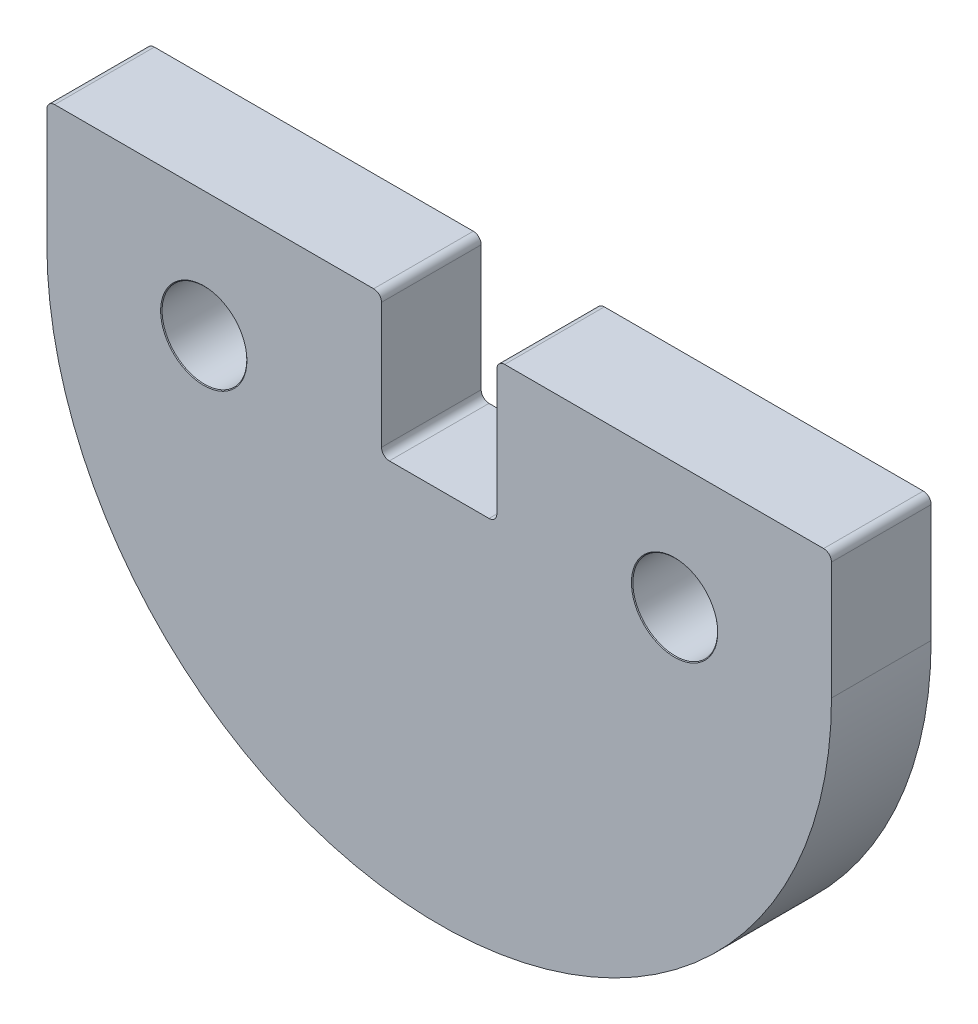
ISO-10303-21;
HEADER;
FILE_DESCRIPTION(('STEP AP214'),'2;1');
FILE_NAME('part.step','',(''),(''),'','','');
FILE_SCHEMA(('AUTOMOTIVE_DESIGN { 1 0 10303 214 1 1 1 1 }'));
ENDSEC;
DATA;
#1=APPLICATION_CONTEXT('core data for automotive mechanical design processes');
#2=APPLICATION_PROTOCOL_DEFINITION('international standard','automotive_design',2000,#1);
#3=PRODUCT_CONTEXT('',#1,'mechanical');
#4=PRODUCT('Part','Part','',(#3));
#5=PRODUCT_RELATED_PRODUCT_CATEGORY('part','',(#4));
#6=PRODUCT_DEFINITION_FORMATION('','',#4);
#7=PRODUCT_DEFINITION_CONTEXT('part definition',#1,'design');
#8=PRODUCT_DEFINITION('design','',#6,#7);
#9=PRODUCT_DEFINITION_SHAPE('','',#8);
#10=(LENGTH_UNIT() NAMED_UNIT(*) SI_UNIT(.MILLI.,.METRE.));
#11=(NAMED_UNIT(*) PLANE_ANGLE_UNIT() SI_UNIT($,.RADIAN.));
#12=(NAMED_UNIT(*) SI_UNIT($,.STERADIAN.) SOLID_ANGLE_UNIT());
#13=UNCERTAINTY_MEASURE_WITH_UNIT(LENGTH_MEASURE(1.E-05),#10,'distance_accuracy_value','');
#14=(GEOMETRIC_REPRESENTATION_CONTEXT(3) GLOBAL_UNCERTAINTY_ASSIGNED_CONTEXT((#13)) GLOBAL_UNIT_ASSIGNED_CONTEXT((#10,
#11,#12)) REPRESENTATION_CONTEXT('',''));
#15=CARTESIAN_POINT('',(0.,0.,0.));
#16=DIRECTION('',(0.,0.,1.));
#17=DIRECTION('',(1.,0.,0.));
#18=AXIS2_PLACEMENT_3D('',#15,#16,#17);
#19=CARTESIAN_POINT('',(-12.5,0.,3.175));
#20=DIRECTION('',(-1.,0.,0.));
#21=DIRECTION('',(0.,0.,1.));
#22=AXIS2_PLACEMENT_3D('',#19,#20,#21);
#23=PLANE('',#22);
#24=DIRECTION('',(0.,1.,0.));
#25=VECTOR('',#24,1.);
#26=CARTESIAN_POINT('',(-12.5,0.,3.175));
#27=LINE('',#26,#25);
#28=CARTESIAN_POINT('',(-12.5,0.,3.175));
#29=VERTEX_POINT('',#28);
#30=CARTESIAN_POINT('',(-12.5,3.75,3.175));
#31=VERTEX_POINT('',#30);
#32=EDGE_CURVE('E155',#29,#31,#27,.T.);
#33=ORIENTED_EDGE('',*,*,#32,.T.);
#34=DIRECTION('',(0.,0.,-1.));
#35=VECTOR('',#34,1.);
#36=CARTESIAN_POINT('',(-12.5,3.75,3.175));
#37=LINE('',#36,#35);
#38=CARTESIAN_POINT('',(-12.5,3.75,0.));
#39=VERTEX_POINT('',#38);
#40=EDGE_CURVE('E308',#31,#39,#37,.T.);
#41=ORIENTED_EDGE('',*,*,#40,.T.);
#42=DIRECTION('',(0.,1.,0.));
#43=VECTOR('',#42,1.);
#44=CARTESIAN_POINT('',(-12.5,0.,0.));
#45=LINE('',#44,#43);
#46=CARTESIAN_POINT('',(-12.5,0.,0.));
#47=VERTEX_POINT('',#46);
#48=EDGE_CURVE('E158',#47,#39,#45,.T.);
#49=ORIENTED_EDGE('',*,*,#48,.F.);
#50=DIRECTION('',(0.,0.,-1.));
#51=VECTOR('',#50,1.);
#52=CARTESIAN_POINT('',(-12.5,0.,3.175));
#53=LINE('',#52,#51);
#54=EDGE_CURVE('E151',#29,#47,#53,.T.);
#55=ORIENTED_EDGE('',*,*,#54,.F.);
#56=EDGE_LOOP('',(#33,#41,#49,#55));
#57=FACE_BOUND('',#56,.T.);
#58=ADVANCED_FACE('F48',(#57),#23,.T.);
#59=CARTESIAN_POINT('',(0.,0.,3.175));
#60=DIRECTION('',(0.,0.,-1.));
#61=DIRECTION('',(-1.,0.,0.));
#62=AXIS2_PLACEMENT_3D('',#59,#60,#61);
#63=CYLINDRICAL_SURFACE('',#62,12.5);
#64=CARTESIAN_POINT('',(0.,0.,0.));
#65=DIRECTION('',(0.,0.,1.));
#66=DIRECTION('',(1.,0.,0.));
#67=AXIS2_PLACEMENT_3D('',#64,#65,#66);
#68=CIRCLE('',#67,12.5);
#69=CARTESIAN_POINT('',(12.5,0.,0.));
#70=VERTEX_POINT('',#69);
#71=EDGE_CURVE('E220',#47,#70,#68,.T.);
#72=ORIENTED_EDGE('',*,*,#71,.T.);
#73=DIRECTION('',(0.,0.,-1.));
#74=VECTOR('',#73,1.);
#75=CARTESIAN_POINT('',(12.5,0.,3.175));
#76=LINE('',#75,#74);
#77=CARTESIAN_POINT('',(12.5,0.,3.175));
#78=VERTEX_POINT('',#77);
#79=EDGE_CURVE('E162',#78,#70,#76,.T.);
#80=ORIENTED_EDGE('',*,*,#79,.F.);
#81=CARTESIAN_POINT('',(0.,0.,3.175));
#82=DIRECTION('',(0.,0.,1.));
#83=DIRECTION('',(1.,0.,0.));
#84=AXIS2_PLACEMENT_3D('',#81,#82,#83);
#85=CIRCLE('',#84,12.5);
#86=EDGE_CURVE('E165',#29,#78,#85,.T.);
#87=ORIENTED_EDGE('',*,*,#86,.F.);
#88=ORIENTED_EDGE('',*,*,#54,.T.);
#89=EDGE_LOOP('',(#72,#80,#87,#88));
#90=FACE_BOUND('',#89,.T.);
#91=ADVANCED_FACE('F166',(#90),#63,.T.);
#92=CARTESIAN_POINT('',(12.5,0.,3.175));
#93=DIRECTION('',(-1.,0.,0.));
#94=DIRECTION('',(0.,0.,1.));
#95=AXIS2_PLACEMENT_3D('',#92,#93,#94);
#96=PLANE('',#95);
#97=DIRECTION('',(0.,1.,0.));
#98=VECTOR('',#97,1.);
#99=CARTESIAN_POINT('',(12.5,0.,0.));
#100=LINE('',#99,#98);
#101=CARTESIAN_POINT('',(12.5,3.75,0.));
#102=VERTEX_POINT('',#101);
#103=EDGE_CURVE('E222',#70,#102,#100,.T.);
#104=ORIENTED_EDGE('',*,*,#103,.T.);
#105=DIRECTION('',(0.,0.,-1.));
#106=VECTOR('',#105,1.);
#107=CARTESIAN_POINT('',(12.5,3.75,3.175));
#108=LINE('',#107,#106);
#109=CARTESIAN_POINT('',(12.5,3.75,3.175));
#110=VERTEX_POINT('',#109);
#111=EDGE_CURVE('E197',#102,#110,#108,.F.);
#112=ORIENTED_EDGE('',*,*,#111,.T.);
#113=DIRECTION('',(0.,1.,0.));
#114=VECTOR('',#113,1.);
#115=CARTESIAN_POINT('',(12.5,0.,3.175));
#116=LINE('',#115,#114);
#117=EDGE_CURVE('E171',#78,#110,#116,.T.);
#118=ORIENTED_EDGE('',*,*,#117,.F.);
#119=ORIENTED_EDGE('',*,*,#79,.T.);
#120=EDGE_LOOP('',(#104,#112,#118,#119));
#121=FACE_BOUND('',#120,.T.);
#122=ADVANCED_FACE('F249',(#121),#96,.F.);
#123=CARTESIAN_POINT('',(0.,4.,3.175));
#124=DIRECTION('',(0.,1.,0.));
#125=DIRECTION('',(0.,0.,1.));
#126=AXIS2_PLACEMENT_3D('',#123,#124,#125);
#127=PLANE('',#126);
#128=DIRECTION('',(1.,0.,0.));
#129=VECTOR('',#128,1.);
#130=CARTESIAN_POINT('',(0.,4.,3.175));
#131=LINE('',#130,#129);
#132=CARTESIAN_POINT('',(2.08750000000307,4.,3.175));
#133=VERTEX_POINT('',#132);
#134=CARTESIAN_POINT('',(12.25,4.,3.175));
#135=VERTEX_POINT('',#134);
#136=EDGE_CURVE('E256',#133,#135,#131,.T.);
#137=ORIENTED_EDGE('',*,*,#136,.T.);
#138=DIRECTION('',(0.,0.,-1.));
#139=VECTOR('',#138,1.);
#140=CARTESIAN_POINT('',(12.25,4.,0.));
#141=LINE('',#140,#139);
#142=CARTESIAN_POINT('',(12.25,4.,0.));
#143=VERTEX_POINT('',#142);
#144=EDGE_CURVE('E235',#135,#143,#141,.T.);
#145=ORIENTED_EDGE('',*,*,#144,.T.);
#146=DIRECTION('',(1.,0.,0.));
#147=VECTOR('',#146,1.);
#148=CARTESIAN_POINT('',(0.,4.,0.));
#149=LINE('',#148,#147);
#150=CARTESIAN_POINT('',(2.08750000000307,4.,0.));
#151=VERTEX_POINT('',#150);
#152=EDGE_CURVE('E182',#151,#143,#149,.T.);
#153=ORIENTED_EDGE('',*,*,#152,.F.);
#154=DIRECTION('',(0.,0.,-1.));
#155=VECTOR('',#154,1.);
#156=CARTESIAN_POINT('',(2.08750000000307,4.,3.175));
#157=LINE('',#156,#155);
#158=EDGE_CURVE('E161',#151,#133,#157,.F.);
#159=ORIENTED_EDGE('',*,*,#158,.T.);
#160=EDGE_LOOP('',(#137,#145,#153,#159));
#161=FACE_BOUND('',#160,.T.);
#162=ADVANCED_FACE('F285',(#161),#127,.T.);
#163=CARTESIAN_POINT('',(1.83750000000036,-1.32557990914983E-12,3.175));
#164=DIRECTION('',(1.,-7.21404032190244E-13,0.));
#165=DIRECTION('',(7.21404032190244E-13,1.,0.));
#166=AXIS2_PLACEMENT_3D('',#163,#164,#165);
#167=PLANE('',#166);
#168=DIRECTION('',(-7.21404032190244E-13,-1.,0.));
#169=VECTOR('',#168,1.);
#170=CARTESIAN_POINT('',(1.83750000000036,-1.32557990914983E-12,0.));
#171=LINE('',#170,#169);
#172=CARTESIAN_POINT('',(1.83750000000307,3.75000000000018,0.));
#173=VERTEX_POINT('',#172);
#174=CARTESIAN_POINT('',(1.83750000000018,-0.250000000000181,0.));
#175=VERTEX_POINT('',#174);
#176=EDGE_CURVE('E225',#173,#175,#171,.T.);
#177=ORIENTED_EDGE('',*,*,#176,.T.);
#178=DIRECTION('',(0.,0.,-1.));
#179=VECTOR('',#178,1.);
#180=CARTESIAN_POINT('',(1.83750000000018,-0.250000000000181,3.175));
#181=LINE('',#180,#179);
#182=CARTESIAN_POINT('',(1.83750000000018,-0.250000000000181,3.175));
#183=VERTEX_POINT('',#182);
#184=EDGE_CURVE('E296',#175,#183,#181,.F.);
#185=ORIENTED_EDGE('',*,*,#184,.T.);
#186=DIRECTION('',(-7.21404032190244E-13,-1.,0.));
#187=VECTOR('',#186,1.);
#188=CARTESIAN_POINT('',(1.83750000000036,-1.32557990914983E-12,3.175));
#189=LINE('',#188,#187);
#190=CARTESIAN_POINT('',(1.83750000000307,3.75000000000018,3.175));
#191=VERTEX_POINT('',#190);
#192=EDGE_CURVE('E275',#191,#183,#189,.T.);
#193=ORIENTED_EDGE('',*,*,#192,.F.);
#194=DIRECTION('',(0.,0.,-1.));
#195=VECTOR('',#194,1.);
#196=CARTESIAN_POINT('',(1.83750000000307,3.75000000000018,0.));
#197=LINE('',#196,#195);
#198=EDGE_CURVE('E293',#191,#173,#197,.T.);
#199=ORIENTED_EDGE('',*,*,#198,.T.);
#200=EDGE_LOOP('',(#177,#185,#193,#199));
#201=FACE_BOUND('',#200,.T.);
#202=ADVANCED_FACE('F320',(#201),#167,.F.);
#203=CARTESIAN_POINT('',(0.,-0.5,3.175));
#204=DIRECTION('',(0.,1.,0.));
#205=DIRECTION('',(0.,0.,1.));
#206=AXIS2_PLACEMENT_3D('',#203,#204,#205);
#207=PLANE('',#206);
#208=DIRECTION('',(1.,0.,0.));
#209=VECTOR('',#208,1.);
#210=CARTESIAN_POINT('',(0.,-0.5,0.));
#211=LINE('',#210,#209);
#212=CARTESIAN_POINT('',(-1.58750000000018,-0.5,0.));
#213=VERTEX_POINT('',#212);
#214=CARTESIAN_POINT('',(1.58750000000018,-0.5,0.));
#215=VERTEX_POINT('',#214);
#216=EDGE_CURVE('E228',#213,#215,#211,.T.);
#217=ORIENTED_EDGE('',*,*,#216,.F.);
#218=DIRECTION('',(0.,0.,-1.));
#219=VECTOR('',#218,1.);
#220=CARTESIAN_POINT('',(-1.58750000000018,-0.5,3.175));
#221=LINE('',#220,#219);
#222=CARTESIAN_POINT('',(-1.58750000000018,-0.5,3.175));
#223=VERTEX_POINT('',#222);
#224=EDGE_CURVE('E297',#213,#223,#221,.F.);
#225=ORIENTED_EDGE('',*,*,#224,.T.);
#226=DIRECTION('',(1.,0.,0.));
#227=VECTOR('',#226,1.);
#228=CARTESIAN_POINT('',(0.,-0.5,3.175));
#229=LINE('',#228,#227);
#230=CARTESIAN_POINT('',(1.58750000000018,-0.5,3.175));
#231=VERTEX_POINT('',#230);
#232=EDGE_CURVE('E216',#223,#231,#229,.T.);
#233=ORIENTED_EDGE('',*,*,#232,.T.);
#234=DIRECTION('',(0.,0.,-1.));
#235=VECTOR('',#234,1.);
#236=CARTESIAN_POINT('',(1.58750000000018,-0.5,3.175));
#237=LINE('',#236,#235);
#238=EDGE_CURVE('E300',#231,#215,#237,.T.);
#239=ORIENTED_EDGE('',*,*,#238,.T.);
#240=EDGE_LOOP('',(#217,#225,#233,#239));
#241=FACE_BOUND('',#240,.T.);
#242=ADVANCED_FACE('F325',(#241),#207,.T.);
#243=CARTESIAN_POINT('',(-1.83750000000036,-1.32557990914983E-12,3.175));
#244=DIRECTION('',(1.,7.21404032190244E-13,0.));
#245=DIRECTION('',(-7.21404032190244E-13,1.,0.));
#246=AXIS2_PLACEMENT_3D('',#243,#244,#245);
#247=PLANE('',#246);
#248=DIRECTION('',(7.21404032190244E-13,-1.,0.));
#249=VECTOR('',#248,1.);
#250=CARTESIAN_POINT('',(-1.83750000000036,-1.32557990914983E-12,3.175));
#251=LINE('',#250,#249);
#252=CARTESIAN_POINT('',(-1.83750000000307,3.75000000000018,3.175));
#253=VERTEX_POINT('',#252);
#254=CARTESIAN_POINT('',(-1.83750000000018,-0.250000000000181,3.175));
#255=VERTEX_POINT('',#254);
#256=EDGE_CURVE('E210',#253,#255,#251,.T.);
#257=ORIENTED_EDGE('',*,*,#256,.T.);
#258=DIRECTION('',(0.,0.,-1.));
#259=VECTOR('',#258,1.);
#260=CARTESIAN_POINT('',(-1.83750000000018,-0.250000000000181,0.));
#261=LINE('',#260,#259);
#262=CARTESIAN_POINT('',(-1.83750000000018,-0.250000000000181,0.));
#263=VERTEX_POINT('',#262);
#264=EDGE_CURVE('E262',#255,#263,#261,.T.);
#265=ORIENTED_EDGE('',*,*,#264,.T.);
#266=DIRECTION('',(7.21404032190244E-13,-1.,0.));
#267=VECTOR('',#266,1.);
#268=CARTESIAN_POINT('',(-1.83750000000036,-1.32557990914983E-12,0.));
#269=LINE('',#268,#267);
#270=CARTESIAN_POINT('',(-1.83750000000307,3.75000000000018,0.));
#271=VERTEX_POINT('',#270);
#272=EDGE_CURVE('E180',#271,#263,#269,.T.);
#273=ORIENTED_EDGE('',*,*,#272,.F.);
#274=DIRECTION('',(0.,0.,-1.));
#275=VECTOR('',#274,1.);
#276=CARTESIAN_POINT('',(-1.83750000000307,3.75000000000018,3.175));
#277=LINE('',#276,#275);
#278=EDGE_CURVE('E260',#271,#253,#277,.F.);
#279=ORIENTED_EDGE('',*,*,#278,.T.);
#280=EDGE_LOOP('',(#257,#265,#273,#279));
#281=FACE_BOUND('',#280,.T.);
#282=ADVANCED_FACE('F332',(#281),#247,.T.);
#283=CARTESIAN_POINT('',(-12.25,4.,3.175));
#284=VERTEX_POINT('',#283);
#285=CARTESIAN_POINT('',(-2.08750000000307,4.,3.175));
#286=VERTEX_POINT('',#285);
#287=EDGE_CURVE('E215',#284,#286,#131,.T.);
#288=ORIENTED_EDGE('',*,*,#287,.T.);
#289=DIRECTION('',(0.,0.,-1.));
#290=VECTOR('',#289,1.);
#291=CARTESIAN_POINT('',(-2.08750000000307,4.,3.175));
#292=LINE('',#291,#290);
#293=CARTESIAN_POINT('',(-2.08750000000307,4.,0.));
#294=VERTEX_POINT('',#293);
#295=EDGE_CURVE('E305',#286,#294,#292,.T.);
#296=ORIENTED_EDGE('',*,*,#295,.T.);
#297=CARTESIAN_POINT('',(-12.25,4.,0.));
#298=VERTEX_POINT('',#297);
#299=EDGE_CURVE('E176',#298,#294,#149,.T.);
#300=ORIENTED_EDGE('',*,*,#299,.F.);
#301=DIRECTION('',(0.,0.,-1.));
#302=VECTOR('',#301,1.);
#303=CARTESIAN_POINT('',(-12.25,4.,3.175));
#304=LINE('',#303,#302);
#305=EDGE_CURVE('E71',#298,#284,#304,.F.);
#306=ORIENTED_EDGE('',*,*,#305,.T.);
#307=EDGE_LOOP('',(#288,#296,#300,#306));
#308=FACE_BOUND('',#307,.T.);
#309=ADVANCED_FACE('F338',(#308),#127,.T.);
#310=CARTESIAN_POINT('',(0.,0.,3.175));
#311=DIRECTION('',(0.,0.,1.));
#312=DIRECTION('',(1.,0.,0.));
#313=AXIS2_PLACEMENT_3D('',#310,#311,#312);
#314=PLANE('',#313);
#315=CARTESIAN_POINT('',(-7.5,0.,3.175));
#316=DIRECTION('',(0.,0.,1.));
#317=DIRECTION('',(1.,0.,0.));
#318=AXIS2_PLACEMENT_3D('',#315,#316,#317);
#319=CIRCLE('',#318,1.375);
#320=CARTESIAN_POINT('',(-6.125,0.,3.175));
#321=VERTEX_POINT('',#320);
#322=EDGE_CURVE('E510',#321,#321,#319,.T.);
#323=ORIENTED_EDGE('',*,*,#322,.F.);
#324=EDGE_LOOP('',(#323));
#325=FACE_BOUND('',#324,.T.);
#326=CARTESIAN_POINT('',(7.5,0.,3.175));
#327=DIRECTION('',(0.,0.,1.));
#328=DIRECTION('',(1.,0.,0.));
#329=AXIS2_PLACEMENT_3D('',#326,#327,#328);
#330=CIRCLE('',#329,1.375);
#331=CARTESIAN_POINT('',(8.875,0.,3.175));
#332=VERTEX_POINT('',#331);
#333=EDGE_CURVE('E513',#332,#332,#330,.T.);
#334=ORIENTED_EDGE('',*,*,#333,.F.);
#335=EDGE_LOOP('',(#334));
#336=FACE_BOUND('',#335,.T.);
#337=ORIENTED_EDGE('',*,*,#117,.T.);
#338=CARTESIAN_POINT('',(12.25,3.75,3.175));
#339=DIRECTION('',(0.,0.,1.));
#340=DIRECTION('',(1.,0.,0.));
#341=AXIS2_PLACEMENT_3D('',#338,#339,#340);
#342=CIRCLE('',#341,0.25);
#343=EDGE_CURVE('E253',#110,#135,#342,.T.);
#344=ORIENTED_EDGE('',*,*,#343,.T.);
#345=ORIENTED_EDGE('',*,*,#136,.F.);
#346=CARTESIAN_POINT('',(2.08750000000307,3.75,3.175));
#347=DIRECTION('',(0.,0.,1.));
#348=DIRECTION('',(1.,0.,0.));
#349=AXIS2_PLACEMENT_3D('',#346,#347,#348);
#350=CIRCLE('',#349,0.25);
#351=EDGE_CURVE('E202',#133,#191,#350,.T.);
#352=ORIENTED_EDGE('',*,*,#351,.T.);
#353=ORIENTED_EDGE('',*,*,#192,.T.);
#354=CARTESIAN_POINT('',(1.58750000000018,-0.25,3.175));
#355=DIRECTION('',(0.,0.,1.));
#356=DIRECTION('',(1.,0.,0.));
#357=AXIS2_PLACEMENT_3D('',#354,#355,#356);
#358=CIRCLE('',#357,0.25);
#359=EDGE_CURVE('E12',#183,#231,#358,.F.);
#360=ORIENTED_EDGE('',*,*,#359,.T.);
#361=ORIENTED_EDGE('',*,*,#232,.F.);
#362=CARTESIAN_POINT('',(-1.58750000000018,-0.25,3.175));
#363=DIRECTION('',(0.,0.,1.));
#364=DIRECTION('',(1.,0.,0.));
#365=AXIS2_PLACEMENT_3D('',#362,#363,#364);
#366=CIRCLE('',#365,0.25);
#367=EDGE_CURVE('E312',#223,#255,#366,.F.);
#368=ORIENTED_EDGE('',*,*,#367,.T.);
#369=ORIENTED_EDGE('',*,*,#256,.F.);
#370=CARTESIAN_POINT('',(-2.08750000000307,3.75,3.175));
#371=DIRECTION('',(0.,0.,1.));
#372=DIRECTION('',(1.,0.,0.));
#373=AXIS2_PLACEMENT_3D('',#370,#371,#372);
#374=CIRCLE('',#373,0.25);
#375=EDGE_CURVE('E64',#253,#286,#374,.T.);
#376=ORIENTED_EDGE('',*,*,#375,.T.);
#377=ORIENTED_EDGE('',*,*,#287,.F.);
#378=CARTESIAN_POINT('',(-12.25,3.75,3.175));
#379=DIRECTION('',(0.,0.,1.));
#380=DIRECTION('',(1.,0.,0.));
#381=AXIS2_PLACEMENT_3D('',#378,#379,#380);
#382=CIRCLE('',#381,0.25);
#383=EDGE_CURVE('E174',#284,#31,#382,.T.);
#384=ORIENTED_EDGE('',*,*,#383,.T.);
#385=ORIENTED_EDGE('',*,*,#32,.F.);
#386=ORIENTED_EDGE('',*,*,#86,.T.);
#387=EDGE_LOOP('',(#337,#344,#345,#352,#353,#360,#361,#368,#369,#376,#377,#384,#385,#386));
#388=FACE_BOUND('',#387,.T.);
#389=ADVANCED_FACE('F172',(#325,#336,#388),#314,.T.);
#390=CARTESIAN_POINT('',(0.,0.,0.));
#391=DIRECTION('',(0.,0.,1.));
#392=DIRECTION('',(1.,0.,0.));
#393=AXIS2_PLACEMENT_3D('',#390,#391,#392);
#394=PLANE('',#393);
#395=CARTESIAN_POINT('',(-7.5,0.,0.));
#396=DIRECTION('',(0.,0.,1.));
#397=DIRECTION('',(1.,0.,0.));
#398=AXIS2_PLACEMENT_3D('',#395,#396,#397);
#399=CIRCLE('',#398,1.35);
#400=CARTESIAN_POINT('',(-6.15,0.,0.));
#401=VERTEX_POINT('',#400);
#402=EDGE_CURVE('E517',#401,#401,#399,.T.);
#403=ORIENTED_EDGE('',*,*,#402,.T.);
#404=EDGE_LOOP('',(#403));
#405=FACE_BOUND('',#404,.T.);
#406=CARTESIAN_POINT('',(7.5,0.,0.));
#407=DIRECTION('',(0.,0.,1.));
#408=DIRECTION('',(1.,0.,0.));
#409=AXIS2_PLACEMENT_3D('',#406,#407,#408);
#410=CIRCLE('',#409,1.35);
#411=CARTESIAN_POINT('',(8.85,0.,0.));
#412=VERTEX_POINT('',#411);
#413=EDGE_CURVE('E185',#412,#412,#410,.T.);
#414=ORIENTED_EDGE('',*,*,#413,.T.);
#415=EDGE_LOOP('',(#414));
#416=FACE_BOUND('',#415,.T.);
#417=ORIENTED_EDGE('',*,*,#152,.T.);
#418=CARTESIAN_POINT('',(12.25,3.75,0.));
#419=DIRECTION('',(0.,0.,1.));
#420=DIRECTION('',(1.,0.,0.));
#421=AXIS2_PLACEMENT_3D('',#418,#419,#420);
#422=CIRCLE('',#421,0.25);
#423=EDGE_CURVE('E243',#143,#102,#422,.F.);
#424=ORIENTED_EDGE('',*,*,#423,.T.);
#425=ORIENTED_EDGE('',*,*,#103,.F.);
#426=ORIENTED_EDGE('',*,*,#71,.F.);
#427=ORIENTED_EDGE('',*,*,#48,.T.);
#428=CARTESIAN_POINT('',(-12.25,3.75,0.));
#429=DIRECTION('',(0.,0.,1.));
#430=DIRECTION('',(1.,0.,0.));
#431=AXIS2_PLACEMENT_3D('',#428,#429,#430);
#432=CIRCLE('',#431,0.25);
#433=EDGE_CURVE('E238',#39,#298,#432,.F.);
#434=ORIENTED_EDGE('',*,*,#433,.T.);
#435=ORIENTED_EDGE('',*,*,#299,.T.);
#436=CARTESIAN_POINT('',(-2.08750000000307,3.75,0.));
#437=DIRECTION('',(0.,0.,1.));
#438=DIRECTION('',(1.,0.,0.));
#439=AXIS2_PLACEMENT_3D('',#436,#437,#438);
#440=CIRCLE('',#439,0.25);
#441=EDGE_CURVE('E240',#294,#271,#440,.F.);
#442=ORIENTED_EDGE('',*,*,#441,.T.);
#443=ORIENTED_EDGE('',*,*,#272,.T.);
#444=CARTESIAN_POINT('',(-1.58750000000018,-0.25,0.));
#445=DIRECTION('',(0.,0.,1.));
#446=DIRECTION('',(1.,0.,0.));
#447=AXIS2_PLACEMENT_3D('',#444,#445,#446);
#448=CIRCLE('',#447,0.25);
#449=EDGE_CURVE('E310',#263,#213,#448,.T.);
#450=ORIENTED_EDGE('',*,*,#449,.T.);
#451=ORIENTED_EDGE('',*,*,#216,.T.);
#452=CARTESIAN_POINT('',(1.58750000000018,-0.25,0.));
#453=DIRECTION('',(0.,0.,1.));
#454=DIRECTION('',(1.,0.,0.));
#455=AXIS2_PLACEMENT_3D('',#452,#453,#454);
#456=CIRCLE('',#455,0.25);
#457=EDGE_CURVE('E57',#215,#175,#456,.T.);
#458=ORIENTED_EDGE('',*,*,#457,.T.);
#459=ORIENTED_EDGE('',*,*,#176,.F.);
#460=CARTESIAN_POINT('',(2.08750000000307,3.75,0.));
#461=DIRECTION('',(0.,0.,1.));
#462=DIRECTION('',(1.,0.,0.));
#463=AXIS2_PLACEMENT_3D('',#460,#461,#462);
#464=CIRCLE('',#463,0.25);
#465=EDGE_CURVE('E242',#173,#151,#464,.F.);
#466=ORIENTED_EDGE('',*,*,#465,.T.);
#467=EDGE_LOOP('',(#417,#424,#425,#426,#427,#434,#435,#442,#443,#450,#451,#458,#459,#466));
#468=FACE_BOUND('',#467,.T.);
#469=ADVANCED_FACE('F314',(#405,#416,#468),#394,.F.);
#470=CARTESIAN_POINT('',(7.5,0.,3.175));
#471=DIRECTION('',(0.,0.,1.));
#472=DIRECTION('',(1.,0.,0.));
#473=AXIS2_PLACEMENT_3D('',#470,#471,#472);
#474=CYLINDRICAL_SURFACE('',#473,1.35);
#475=ORIENTED_EDGE('',*,*,#413,.F.);
#476=EDGE_LOOP('',(#475));
#477=FACE_BOUND('',#476,.T.);
#478=CARTESIAN_POINT('',(7.5,0.,3.15402250922057));
#479=DIRECTION('',(0.,0.,1.));
#480=DIRECTION('',(1.,0.,0.));
#481=AXIS2_PLACEMENT_3D('',#478,#479,#480);
#482=CIRCLE('',#481,1.35);
#483=CARTESIAN_POINT('',(8.85,0.,3.15402250922057));
#484=VERTEX_POINT('',#483);
#485=EDGE_CURVE('E516',#484,#484,#482,.T.);
#486=ORIENTED_EDGE('',*,*,#485,.T.);
#487=EDGE_LOOP('',(#486));
#488=FACE_BOUND('',#487,.T.);
#489=ADVANCED_FACE('F416',(#477,#488),#474,.F.);
#490=CARTESIAN_POINT('',(7.5,0.,3.175));
#491=DIRECTION('',(0.,0.,1.));
#492=DIRECTION('',(1.,0.,0.));
#493=AXIS2_PLACEMENT_3D('',#490,#491,#492);
#494=CONICAL_SURFACE('',#493,1.375,0.872664625997165);
#495=ORIENTED_EDGE('',*,*,#485,.F.);
#496=EDGE_LOOP('',(#495));
#497=FACE_BOUND('',#496,.T.);
#498=ORIENTED_EDGE('',*,*,#333,.T.);
#499=EDGE_LOOP('',(#498));
#500=FACE_BOUND('',#499,.T.);
#501=ADVANCED_FACE('F407',(#497,#500),#494,.F.);
#502=CARTESIAN_POINT('',(-7.5,0.,3.175));
#503=DIRECTION('',(0.,0.,1.));
#504=DIRECTION('',(1.,0.,0.));
#505=AXIS2_PLACEMENT_3D('',#502,#503,#504);
#506=CYLINDRICAL_SURFACE('',#505,1.35);
#507=ORIENTED_EDGE('',*,*,#402,.F.);
#508=EDGE_LOOP('',(#507));
#509=FACE_BOUND('',#508,.T.);
#510=CARTESIAN_POINT('',(-7.5,0.,3.15402250922057));
#511=DIRECTION('',(0.,0.,1.));
#512=DIRECTION('',(1.,0.,0.));
#513=AXIS2_PLACEMENT_3D('',#510,#511,#512);
#514=CIRCLE('',#513,1.35);
#515=CARTESIAN_POINT('',(-6.15,0.,3.15402250922057));
#516=VERTEX_POINT('',#515);
#517=EDGE_CURVE('E522',#516,#516,#514,.T.);
#518=ORIENTED_EDGE('',*,*,#517,.T.);
#519=EDGE_LOOP('',(#518));
#520=FACE_BOUND('',#519,.T.);
#521=ADVANCED_FACE('F398',(#509,#520),#506,.F.);
#522=CARTESIAN_POINT('',(-7.5,0.,3.175));
#523=DIRECTION('',(0.,0.,1.));
#524=DIRECTION('',(1.,0.,0.));
#525=AXIS2_PLACEMENT_3D('',#522,#523,#524);
#526=CONICAL_SURFACE('',#525,1.375,0.872664625997182);
#527=ORIENTED_EDGE('',*,*,#517,.F.);
#528=EDGE_LOOP('',(#527));
#529=FACE_BOUND('',#528,.T.);
#530=ORIENTED_EDGE('',*,*,#322,.T.);
#531=EDGE_LOOP('',(#530));
#532=FACE_BOUND('',#531,.T.);
#533=ADVANCED_FACE('F356',(#529,#532),#526,.F.);
#534=CARTESIAN_POINT('',(12.25,3.75,3.175));
#535=DIRECTION('',(0.,0.,1.));
#536=DIRECTION('',(1.,0.,0.));
#537=AXIS2_PLACEMENT_3D('',#534,#535,#536);
#538=CYLINDRICAL_SURFACE('',#537,0.25);
#539=ORIENTED_EDGE('',*,*,#343,.F.);
#540=ORIENTED_EDGE('',*,*,#111,.F.);
#541=ORIENTED_EDGE('',*,*,#423,.F.);
#542=ORIENTED_EDGE('',*,*,#144,.F.);
#543=EDGE_LOOP('',(#539,#540,#541,#542));
#544=FACE_BOUND('',#543,.T.);
#545=ADVANCED_FACE('F258',(#544),#538,.T.);
#546=CARTESIAN_POINT('',(-1.58750000000018,-0.25,3.175));
#547=DIRECTION('',(0.,0.,1.));
#548=DIRECTION('',(1.,0.,0.));
#549=AXIS2_PLACEMENT_3D('',#546,#547,#548);
#550=CYLINDRICAL_SURFACE('',#549,0.25);
#551=ORIENTED_EDGE('',*,*,#367,.F.);
#552=ORIENTED_EDGE('',*,*,#224,.F.);
#553=ORIENTED_EDGE('',*,*,#449,.F.);
#554=ORIENTED_EDGE('',*,*,#264,.F.);
#555=EDGE_LOOP('',(#551,#552,#553,#554));
#556=FACE_BOUND('',#555,.T.);
#557=ADVANCED_FACE('F328',(#556),#550,.F.);
#558=CARTESIAN_POINT('',(1.58750000000018,-0.25,3.175));
#559=DIRECTION('',(0.,0.,-1.));
#560=DIRECTION('',(-1.,0.,0.));
#561=AXIS2_PLACEMENT_3D('',#558,#559,#560);
#562=CYLINDRICAL_SURFACE('',#561,0.25);
#563=ORIENTED_EDGE('',*,*,#359,.F.);
#564=ORIENTED_EDGE('',*,*,#184,.F.);
#565=ORIENTED_EDGE('',*,*,#457,.F.);
#566=ORIENTED_EDGE('',*,*,#238,.F.);
#567=EDGE_LOOP('',(#563,#564,#565,#566));
#568=FACE_BOUND('',#567,.T.);
#569=ADVANCED_FACE('F321',(#568),#562,.F.);
#570=CARTESIAN_POINT('',(2.08750000000307,3.75,3.175));
#571=DIRECTION('',(0.,0.,1.));
#572=DIRECTION('',(1.,0.,0.));
#573=AXIS2_PLACEMENT_3D('',#570,#571,#572);
#574=CYLINDRICAL_SURFACE('',#573,0.25);
#575=ORIENTED_EDGE('',*,*,#351,.F.);
#576=ORIENTED_EDGE('',*,*,#158,.F.);
#577=ORIENTED_EDGE('',*,*,#465,.F.);
#578=ORIENTED_EDGE('',*,*,#198,.F.);
#579=EDGE_LOOP('',(#575,#576,#577,#578));
#580=FACE_BOUND('',#579,.T.);
#581=ADVANCED_FACE('F291',(#580),#574,.T.);
#582=CARTESIAN_POINT('',(-2.08750000000307,3.75,3.175));
#583=DIRECTION('',(0.,0.,-1.));
#584=DIRECTION('',(-1.,0.,0.));
#585=AXIS2_PLACEMENT_3D('',#582,#583,#584);
#586=CYLINDRICAL_SURFACE('',#585,0.25);
#587=ORIENTED_EDGE('',*,*,#375,.F.);
#588=ORIENTED_EDGE('',*,*,#278,.F.);
#589=ORIENTED_EDGE('',*,*,#441,.F.);
#590=ORIENTED_EDGE('',*,*,#295,.F.);
#591=EDGE_LOOP('',(#587,#588,#589,#590));
#592=FACE_BOUND('',#591,.T.);
#593=ADVANCED_FACE('F336',(#592),#586,.T.);
#594=CARTESIAN_POINT('',(-12.25,3.75,3.175));
#595=DIRECTION('',(0.,0.,-1.));
#596=DIRECTION('',(-1.,0.,0.));
#597=AXIS2_PLACEMENT_3D('',#594,#595,#596);
#598=CYLINDRICAL_SURFACE('',#597,0.25);
#599=ORIENTED_EDGE('',*,*,#383,.F.);
#600=ORIENTED_EDGE('',*,*,#305,.F.);
#601=ORIENTED_EDGE('',*,*,#433,.F.);
#602=ORIENTED_EDGE('',*,*,#40,.F.);
#603=EDGE_LOOP('',(#599,#600,#601,#602));
#604=FACE_BOUND('',#603,.T.);
#605=ADVANCED_FACE('F50',(#604),#598,.T.);
#606=CLOSED_SHELL('',(#58,#91,#122,#162,#202,#242,#282,#309,#389,#469,#489,#501,#521,#533,#545,
#557,#569,#581,#593,#605));
#607=MANIFOLD_SOLID_BREP('B2',#606);
#608=ADVANCED_BREP_SHAPE_REPRESENTATION('',(#18,#607),#14);
#609=SHAPE_DEFINITION_REPRESENTATION(#9,#608);
ENDSEC;
END-ISO-10303-21;
